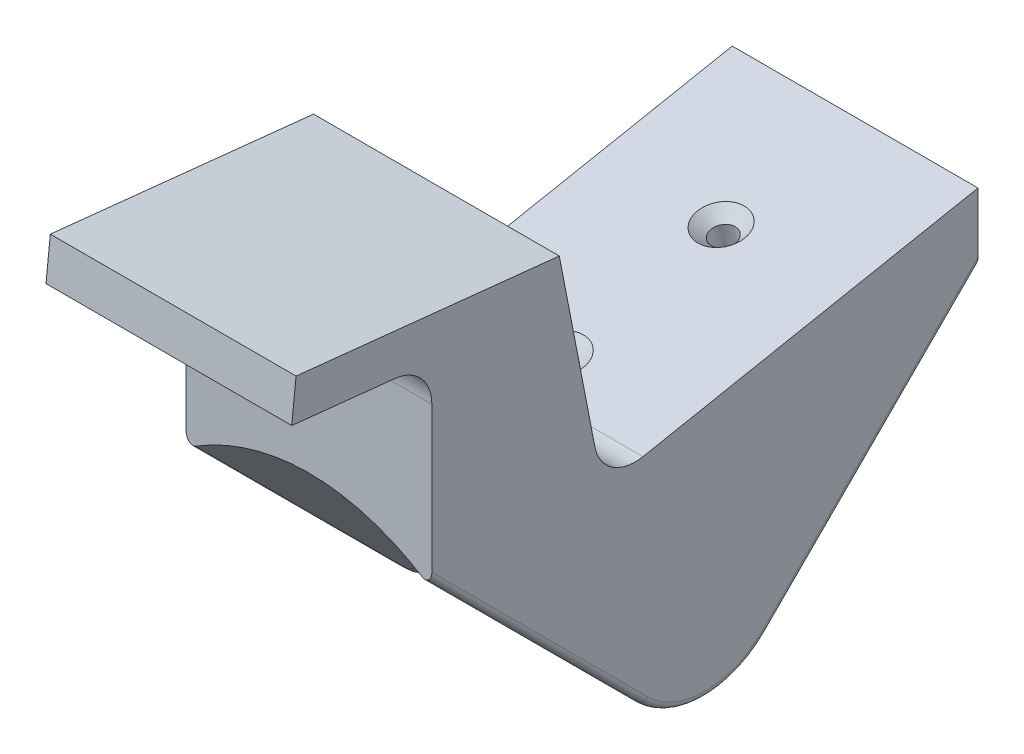
ISO-10303-21;
HEADER;
FILE_DESCRIPTION(('STEP AP214'),'2;1');
FILE_NAME('part.step','',(''),(''),'','','');
FILE_SCHEMA(('AUTOMOTIVE_DESIGN { 1 0 10303 214 1 1 1 1 }'));
ENDSEC;
DATA;
#1=APPLICATION_CONTEXT('core data for automotive mechanical design processes');
#2=APPLICATION_PROTOCOL_DEFINITION('international standard','automotive_design',2000,#1);
#3=PRODUCT_CONTEXT('',#1,'mechanical');
#4=PRODUCT('Part','Part','',(#3));
#5=PRODUCT_RELATED_PRODUCT_CATEGORY('part','',(#4));
#6=PRODUCT_DEFINITION_FORMATION('','',#4);
#7=PRODUCT_DEFINITION_CONTEXT('part definition',#1,'design');
#8=PRODUCT_DEFINITION('design','',#6,#7);
#9=PRODUCT_DEFINITION_SHAPE('','',#8);
#10=(LENGTH_UNIT() NAMED_UNIT(*) SI_UNIT(.MILLI.,.METRE.));
#11=(NAMED_UNIT(*) PLANE_ANGLE_UNIT() SI_UNIT($,.RADIAN.));
#12=(NAMED_UNIT(*) SI_UNIT($,.STERADIAN.) SOLID_ANGLE_UNIT());
#13=UNCERTAINTY_MEASURE_WITH_UNIT(LENGTH_MEASURE(1.E-05),#10,'distance_accuracy_value','');
#14=(GEOMETRIC_REPRESENTATION_CONTEXT(3) GLOBAL_UNCERTAINTY_ASSIGNED_CONTEXT((#13)) GLOBAL_UNIT_ASSIGNED_CONTEXT((#10,
#11,#12)) REPRESENTATION_CONTEXT('',''));
#15=CARTESIAN_POINT('',(0.,0.,0.));
#16=DIRECTION('',(0.,0.,1.));
#17=DIRECTION('',(1.,0.,0.));
#18=AXIS2_PLACEMENT_3D('',#15,#16,#17);
#19=CARTESIAN_POINT('',(9.,0.,0.));
#20=DIRECTION('',(1.,0.,0.));
#21=DIRECTION('',(0.,0.,-1.));
#22=AXIS2_PLACEMENT_3D('',#19,#20,#21);
#23=PLANE('',#22);
#24=DIRECTION('',(0.,0.104528463267647,0.994521895368274));
#25=VECTOR('',#24,1.);
#26=CARTESIAN_POINT('',(9.,27.0189501731692,10.6659343997796));
#27=LINE('',#26,#25);
#28=CARTESIAN_POINT('',(9.,27.0189501731692,10.6659343997796));
#29=VERTEX_POINT('',#28);
#30=CARTESIAN_POINT('',(9.,29.0452846326765,29.9452189536827));
#31=VERTEX_POINT('',#30);
#32=EDGE_CURVE('E169',#29,#31,#27,.T.);
#33=ORIENTED_EDGE('',*,*,#32,.T.);
#34=DIRECTION('',(0.,0.994521895368274,-0.104528463267647));
#35=VECTOR('',#34,1.);
#36=CARTESIAN_POINT('',(9.,29.0452846326765,29.9452189536827));
#37=LINE('',#36,#35);
#38=CARTESIAN_POINT('',(9.,26.0617189465716,30.2588043434857));
#39=VERTEX_POINT('',#38);
#40=EDGE_CURVE('E167',#39,#31,#37,.T.);
#41=ORIENTED_EDGE('',*,*,#40,.F.);
#42=DIRECTION('',(0.,0.104528463267647,0.994521895368274));
#43=VECTOR('',#42,1.);
#44=CARTESIAN_POINT('',(9.,26.0617189465716,30.2588043434857));
#45=LINE('',#44,#43);
#46=CARTESIAN_POINT('',(9.,25.2658287145207,22.6864146101971));
#47=VERTEX_POINT('',#46);
#48=EDGE_CURVE('E156',#47,#39,#45,.T.);
#49=ORIENTED_EDGE('',*,*,#48,.F.);
#50=CARTESIAN_POINT('',(9.,22.2822630284159,23.));
#51=DIRECTION('',(1.,0.,0.));
#52=DIRECTION('',(0.,0.,-1.));
#53=AXIS2_PLACEMENT_3D('',#50,#51,#52);
#54=CIRCLE('',#53,3.);
#55=CARTESIAN_POINT('',(9.,22.2822630284159,20.));
#56=VERTEX_POINT('',#55);
#57=EDGE_CURVE('E11',#47,#56,#54,.F.);
#58=ORIENTED_EDGE('',*,*,#57,.T.);
#59=DIRECTION('',(0.,1.,0.));
#60=VECTOR('',#59,1.);
#61=CARTESIAN_POINT('',(9.,30.,20.));
#62=LINE('',#61,#60);
#63=CARTESIAN_POINT('',(9.,11.6246971195752,20.));
#64=VERTEX_POINT('',#63);
#65=EDGE_CURVE('E230',#64,#56,#62,.T.);
#66=ORIENTED_EDGE('',*,*,#65,.F.);
#67=DIRECTION('',(0.,-0.707106781186552,-0.707106781186544));
#68=VECTOR('',#67,1.);
#69=CARTESIAN_POINT('',(9.,11.073873766785,19.4491766472098));
#70=LINE('',#69,#68);
#71=CARTESIAN_POINT('',(9.,-4.18765144021247,4.18765144021251));
#72=VERTEX_POINT('',#71);
#73=EDGE_CURVE('E288',#72,#64,#70,.F.);
#74=ORIENTED_EDGE('',*,*,#73,.F.);
#75=CARTESIAN_POINT('',(9.,0.,0.));
#76=DIRECTION('',(1.,0.,0.));
#77=DIRECTION('',(0.,0.,-1.));
#78=AXIS2_PLACEMENT_3D('',#75,#76,#77);
#79=CIRCLE('',#78,5.92223346123973);
#80=CARTESIAN_POINT('',(9.,-4.18765144021247,-4.18765144021251));
#81=VERTEX_POINT('',#80);
#82=EDGE_CURVE('E324',#72,#81,#79,.T.);
#83=ORIENTED_EDGE('',*,*,#82,.T.);
#84=DIRECTION('',(0.,-0.707106781186552,0.707106781186544));
#85=VECTOR('',#84,1.);
#86=CARTESIAN_POINT('',(9.,11.073873766785,-19.4491766472098));
#87=LINE('',#86,#85);
#88=CARTESIAN_POINT('',(9.,11.6246971195752,-20.));
#89=VERTEX_POINT('',#88);
#90=EDGE_CURVE('E326',#81,#89,#87,.F.);
#91=ORIENTED_EDGE('',*,*,#90,.T.);
#92=DIRECTION('',(0.,1.,0.));
#93=VECTOR('',#92,1.);
#94=CARTESIAN_POINT('',(9.,30.,-20.));
#95=LINE('',#94,#93);
#96=CARTESIAN_POINT('',(9.,16.,-20.));
#97=VERTEX_POINT('',#96);
#98=EDGE_CURVE('E308',#89,#97,#95,.T.);
#99=ORIENTED_EDGE('',*,*,#98,.T.);
#100=DIRECTION('',(0.,0.190808995376538,-0.981627183447665));
#101=VECTOR('',#100,1.);
#102=CARTESIAN_POINT('',(9.,11.6714049023753,2.26869129299512));
#103=LINE('',#102,#101);
#104=CARTESIAN_POINT('',(9.,11.2297751155865,4.54067958619163));
#105=VERTEX_POINT('',#104);
#106=EDGE_CURVE('E214',#105,#97,#103,.T.);
#107=ORIENTED_EDGE('',*,*,#106,.F.);
#108=CARTESIAN_POINT('',(9.,14.1746566659295,5.11310657232125));
#109=DIRECTION('',(1.,0.,0.));
#110=DIRECTION('',(0.,0.,-1.));
#111=AXIS2_PLACEMENT_3D('',#108,#109,#110);
#112=CIRCLE('',#111,3.);
#113=CARTESIAN_POINT('',(9.,13.6022296797999,8.05798812266424));
#114=VERTEX_POINT('',#113);
#115=EDGE_CURVE('E247',#105,#114,#112,.F.);
#116=ORIENTED_EDGE('',*,*,#115,.T.);
#117=DIRECTION('',(0.,-0.981627183447665,-0.190808995376539));
#118=VECTOR('',#117,1.);
#119=CARTESIAN_POINT('',(9.,-1.01405677291842,5.2168698435395));
#120=LINE('',#119,#118);
#121=EDGE_CURVE('E209',#29,#114,#120,.T.);
#122=ORIENTED_EDGE('',*,*,#121,.F.);
#123=EDGE_LOOP('',(#33,#41,#49,#58,#66,#74,#83,#91,#99,#107,#116,#122));
#124=FACE_BOUND('',#123,.T.);
#125=ADVANCED_FACE('F41',(#124),#23,.T.);
#126=CARTESIAN_POINT('',(-9.,0.,0.));
#127=DIRECTION('',(1.,0.,0.));
#128=DIRECTION('',(0.,0.,-1.));
#129=AXIS2_PLACEMENT_3D('',#126,#127,#128);
#130=PLANE('',#129);
#131=DIRECTION('',(0.,1.,0.));
#132=VECTOR('',#131,1.);
#133=CARTESIAN_POINT('',(-9.,30.,20.));
#134=LINE('',#133,#132);
#135=CARTESIAN_POINT('',(-9.,11.6246971195752,20.));
#136=VERTEX_POINT('',#135);
#137=CARTESIAN_POINT('',(-9.,22.2822630284159,20.));
#138=VERTEX_POINT('',#137);
#139=EDGE_CURVE('E224',#136,#138,#134,.T.);
#140=ORIENTED_EDGE('',*,*,#139,.T.);
#141=CARTESIAN_POINT('',(-9.,22.2822630284159,23.));
#142=DIRECTION('',(1.,0.,0.));
#143=DIRECTION('',(0.,0.,-1.));
#144=AXIS2_PLACEMENT_3D('',#141,#142,#143);
#145=CIRCLE('',#144,3.);
#146=CARTESIAN_POINT('',(-9.,25.2658287145207,22.6864146101971));
#147=VERTEX_POINT('',#146);
#148=EDGE_CURVE('E49',#138,#147,#145,.T.);
#149=ORIENTED_EDGE('',*,*,#148,.T.);
#150=DIRECTION('',(0.,0.104528463267647,0.994521895368274));
#151=VECTOR('',#150,1.);
#152=CARTESIAN_POINT('',(-9.,26.0617189465716,30.2588043434857));
#153=LINE('',#152,#151);
#154=CARTESIAN_POINT('',(-9.,26.0617189465716,30.2588043434857));
#155=VERTEX_POINT('',#154);
#156=EDGE_CURVE('E243',#147,#155,#153,.T.);
#157=ORIENTED_EDGE('',*,*,#156,.T.);
#158=DIRECTION('',(0.,0.994521895368274,-0.104528463267647));
#159=VECTOR('',#158,1.);
#160=CARTESIAN_POINT('',(-9.,29.0452846326765,29.9452189536827));
#161=LINE('',#160,#159);
#162=CARTESIAN_POINT('',(-9.,29.0452846326765,29.9452189536827));
#163=VERTEX_POINT('',#162);
#164=EDGE_CURVE('E164',#155,#163,#161,.T.);
#165=ORIENTED_EDGE('',*,*,#164,.T.);
#166=DIRECTION('',(0.,0.104528463267647,0.994521895368274));
#167=VECTOR('',#166,1.);
#168=CARTESIAN_POINT('',(-9.,27.0189501731692,10.6659343997796));
#169=LINE('',#168,#167);
#170=CARTESIAN_POINT('',(-9.,27.0189501731692,10.6659343997796));
#171=VERTEX_POINT('',#170);
#172=EDGE_CURVE('E182',#171,#163,#169,.T.);
#173=ORIENTED_EDGE('',*,*,#172,.F.);
#174=DIRECTION('',(0.,-0.981627183447665,-0.190808995376539));
#175=VECTOR('',#174,1.);
#176=CARTESIAN_POINT('',(-9.,-1.01405677291842,5.2168698435395));
#177=LINE('',#176,#175);
#178=CARTESIAN_POINT('',(-9.,13.6022296797999,8.05798812266424));
#179=VERTEX_POINT('',#178);
#180=EDGE_CURVE('E206',#171,#179,#177,.T.);
#181=ORIENTED_EDGE('',*,*,#180,.T.);
#182=CARTESIAN_POINT('',(-9.,14.1746566659295,5.11310657232125));
#183=DIRECTION('',(1.,0.,0.));
#184=DIRECTION('',(0.,0.,-1.));
#185=AXIS2_PLACEMENT_3D('',#182,#183,#184);
#186=CIRCLE('',#185,3.);
#187=CARTESIAN_POINT('',(-9.,11.2297751155865,4.54067958619163));
#188=VERTEX_POINT('',#187);
#189=EDGE_CURVE('E250',#179,#188,#186,.T.);
#190=ORIENTED_EDGE('',*,*,#189,.T.);
#191=DIRECTION('',(0.,0.190808995376538,-0.981627183447665));
#192=VECTOR('',#191,1.);
#193=CARTESIAN_POINT('',(-9.,11.6714049023753,2.26869129299512));
#194=LINE('',#193,#192);
#195=CARTESIAN_POINT('',(-9.,16.,-20.));
#196=VERTEX_POINT('',#195);
#197=EDGE_CURVE('E212',#188,#196,#194,.T.);
#198=ORIENTED_EDGE('',*,*,#197,.T.);
#199=DIRECTION('',(0.,1.,0.));
#200=VECTOR('',#199,1.);
#201=CARTESIAN_POINT('',(-9.,30.,-20.));
#202=LINE('',#201,#200);
#203=CARTESIAN_POINT('',(-9.,11.6246971195752,-20.));
#204=VERTEX_POINT('',#203);
#205=EDGE_CURVE('E307',#204,#196,#202,.T.);
#206=ORIENTED_EDGE('',*,*,#205,.F.);
#207=DIRECTION('',(0.,0.707106781186552,-0.707106781186544));
#208=VECTOR('',#207,1.);
#209=CARTESIAN_POINT('',(-9.,-4.18765144021246,-4.18765144021251));
#210=LINE('',#209,#208);
#211=CARTESIAN_POINT('',(-9.,-4.18765144021247,-4.18765144021251));
#212=VERTEX_POINT('',#211);
#213=EDGE_CURVE('E322',#204,#212,#210,.F.);
#214=ORIENTED_EDGE('',*,*,#213,.T.);
#215=CARTESIAN_POINT('',(-9.,0.,0.));
#216=DIRECTION('',(1.,0.,0.));
#217=DIRECTION('',(0.,0.,-1.));
#218=AXIS2_PLACEMENT_3D('',#215,#216,#217);
#219=CIRCLE('',#218,5.92223346123973);
#220=CARTESIAN_POINT('',(-9.,-4.18765144021247,4.18765144021251));
#221=VERTEX_POINT('',#220);
#222=EDGE_CURVE('E284',#212,#221,#219,.F.);
#223=ORIENTED_EDGE('',*,*,#222,.T.);
#224=DIRECTION('',(0.,0.707106781186552,0.707106781186544));
#225=VECTOR('',#224,1.);
#226=CARTESIAN_POINT('',(-9.,-4.18765144021246,4.18765144021251));
#227=LINE('',#226,#225);
#228=EDGE_CURVE('E282',#136,#221,#227,.F.);
#229=ORIENTED_EDGE('',*,*,#228,.F.);
#230=EDGE_LOOP('',(#140,#149,#157,#165,#173,#181,#190,#198,#206,#214,#223,#229));
#231=FACE_BOUND('',#230,.T.);
#232=ADVANCED_FACE('F253',(#231),#130,.F.);
#233=CARTESIAN_POINT('',(0.,-17.974654377762,-17.9746543777621));
#234=DIRECTION('',(0.,0.707106781186552,-0.707106781186544));
#235=DIRECTION('',(0.,0.707106781186544,0.707106781186552));
#236=AXIS2_PLACEMENT_3D('',#233,#234,#235);
#237=CYLINDRICAL_SURFACE('',#236,20.77);
#238=CARTESIAN_POINT('',(0.,-17.974654377762,-17.9746543777621));
#239=DIRECTION('',(0.,0.707106781186551,-0.707106781186544));
#240=DIRECTION('',(1.,0.,0.));
#241=AXIS2_PLACEMENT_3D('',#238,#239,#240);
#242=CIRCLE('',#241,20.77);
#243=CARTESIAN_POINT('',(-8.30018805829807,-4.51174647870681,-4.51174647870686));
#244=VERTEX_POINT('',#243);
#245=CARTESIAN_POINT('',(8.30018805829807,-4.51174647870682,-4.51174647870686));
#246=VERTEX_POINT('',#245);
#247=EDGE_CURVE('E303',#244,#246,#242,.T.);
#248=ORIENTED_EDGE('',*,*,#247,.F.);
#249=DIRECTION('',(0.,0.707106781186552,-0.707106781186544));
#250=VECTOR('',#249,1.);
#251=CARTESIAN_POINT('',(-8.30018805829807,-4.51174647870682,-4.51174647870685));
#252=LINE('',#251,#250);
#253=CARTESIAN_POINT('',(-8.30018805829807,10.9765070425865,-20.));
#254=VERTEX_POINT('',#253);
#255=EDGE_CURVE('E314',#244,#254,#252,.T.);
#256=ORIENTED_EDGE('',*,*,#255,.T.);
#257=CARTESIAN_POINT('',(0.,-15.9493087555241,-20.));
#258=DIRECTION('',(0.,0.,-1.));
#259=DIRECTION('',(0.,1.,0.));
#260=AXIS2_PLACEMENT_3D('',#257,#258,#259);
#261=ELLIPSE('',#260,29.3732156904894,20.77);
#262=CARTESIAN_POINT('',(8.30018805829807,10.9765070425865,-20.));
#263=VERTEX_POINT('',#262);
#264=EDGE_CURVE('E300',#263,#254,#261,.F.);
#265=ORIENTED_EDGE('',*,*,#264,.F.);
#266=DIRECTION('',(0.,0.707106781186552,-0.707106781186544));
#267=VECTOR('',#266,1.);
#268=CARTESIAN_POINT('',(8.30018805829807,-4.51174647870682,-4.51174647870685));
#269=LINE('',#268,#267);
#270=EDGE_CURVE('E311',#263,#246,#269,.F.);
#271=ORIENTED_EDGE('',*,*,#270,.T.);
#272=EDGE_LOOP('',(#248,#256,#265,#271));
#273=FACE_BOUND('',#272,.T.);
#274=ADVANCED_FACE('F350',(#273),#237,.F.);
#275=CARTESIAN_POINT('',(9.,30.,-20.));
#276=DIRECTION('',(0.,0.,1.));
#277=DIRECTION('',(1.,0.,0.));
#278=AXIS2_PLACEMENT_3D('',#275,#276,#277);
#279=PLANE('',#278);
#280=ORIENTED_EDGE('',*,*,#205,.T.);
#281=DIRECTION('',(1.,0.,0.));
#282=VECTOR('',#281,1.);
#283=CARTESIAN_POINT('',(-20.,16.,-20.));
#284=LINE('',#283,#282);
#285=EDGE_CURVE('E203',#196,#97,#284,.T.);
#286=ORIENTED_EDGE('',*,*,#285,.T.);
#287=ORIENTED_EDGE('',*,*,#98,.F.);
#288=CARTESIAN_POINT('',(8.5,11.6246971195752,-20.));
#289=DIRECTION('',(0.,0.,1.));
#290=DIRECTION('',(0.,1.,0.));
#291=AXIS2_PLACEMENT_3D('',#288,#289,#290);
#292=ELLIPSE('',#291,0.707106781186552,0.5);
#293=EDGE_CURVE('E317',#89,#263,#292,.F.);
#294=ORIENTED_EDGE('',*,*,#293,.T.);
#295=ORIENTED_EDGE('',*,*,#264,.T.);
#296=CARTESIAN_POINT('',(-8.5,11.6246971195752,-20.));
#297=DIRECTION('',(0.,0.,1.));
#298=DIRECTION('',(0.,1.,0.));
#299=AXIS2_PLACEMENT_3D('',#296,#297,#298);
#300=ELLIPSE('',#299,0.707106781186552,0.5);
#301=EDGE_CURVE('E319',#254,#204,#300,.F.);
#302=ORIENTED_EDGE('',*,*,#301,.T.);
#303=EDGE_LOOP('',(#280,#286,#287,#294,#295,#302));
#304=FACE_BOUND('',#303,.T.);
#305=ADVANCED_FACE('F356',(#304),#279,.F.);
#306=CARTESIAN_POINT('',(0.,0.,0.));
#307=DIRECTION('',(-1.,0.,0.));
#308=DIRECTION('',(0.,0.,1.));
#309=AXIS2_PLACEMENT_3D('',#306,#307,#308);
#310=TOROIDAL_SURFACE('',#309,25.42,20.77);
#311=CARTESIAN_POINT('',(8.30018805829807,0.,0.));
#312=DIRECTION('',(-1.,0.,0.));
#313=DIRECTION('',(0.,0.,1.));
#314=AXIS2_PLACEMENT_3D('',#311,#312,#313);
#315=CIRCLE('',#314,6.38057306017627);
#316=CARTESIAN_POINT('',(8.30018805829807,-4.51174647870682,4.51174647870686));
#317=VERTEX_POINT('',#316);
#318=EDGE_CURVE('E271',#246,#317,#315,.T.);
#319=ORIENTED_EDGE('',*,*,#318,.T.);
#320=CARTESIAN_POINT('',(0.,-17.974654377762,17.9746543777621));
#321=DIRECTION('',(0.,-0.707106781186551,-0.707106781186544));
#322=DIRECTION('',(1.,0.,0.));
#323=AXIS2_PLACEMENT_3D('',#320,#321,#322);
#324=CIRCLE('',#323,20.77);
#325=CARTESIAN_POINT('',(-8.30018805829807,-4.51174647870682,4.51174647870686));
#326=VERTEX_POINT('',#325);
#327=EDGE_CURVE('E220',#326,#317,#324,.T.);
#328=ORIENTED_EDGE('',*,*,#327,.F.);
#329=CARTESIAN_POINT('',(-8.30018805829807,0.,0.));
#330=DIRECTION('',(1.,0.,0.));
#331=DIRECTION('',(0.,0.,-1.));
#332=AXIS2_PLACEMENT_3D('',#329,#330,#331);
#333=CIRCLE('',#332,6.38057306017626);
#334=EDGE_CURVE('E269',#326,#244,#333,.T.);
#335=ORIENTED_EDGE('',*,*,#334,.T.);
#336=ORIENTED_EDGE('',*,*,#247,.T.);
#337=EDGE_LOOP('',(#319,#328,#335,#336));
#338=FACE_BOUND('',#337,.T.);
#339=ADVANCED_FACE('F347',(#338),#310,.F.);
#340=CARTESIAN_POINT('',(-8.5,0.,0.));
#341=DIRECTION('',(-1.,0.,0.));
#342=DIRECTION('',(0.,0.,1.));
#343=AXIS2_PLACEMENT_3D('',#340,#341,#342);
#344=TOROIDAL_SURFACE('',#343,5.92223346123973,0.5);
#345=ORIENTED_EDGE('',*,*,#334,.F.);
#346=CARTESIAN_POINT('',(-8.5,-4.18765144021247,4.18765144021251));
#347=DIRECTION('',(0.,-0.70710678118655,-0.707106781186546));
#348=DIRECTION('',(0.,0.707106781186546,-0.70710678118655));
#349=AXIS2_PLACEMENT_3D('',#346,#347,#348);
#350=CIRCLE('',#349,0.5);
#351=EDGE_CURVE('E221',#326,#221,#350,.T.);
#352=ORIENTED_EDGE('',*,*,#351,.T.);
#353=ORIENTED_EDGE('',*,*,#222,.F.);
#354=CARTESIAN_POINT('',(-8.5,-4.18765144021247,-4.18765144021251));
#355=DIRECTION('',(0.,0.70710678118655,-0.707106781186546));
#356=DIRECTION('',(0.,0.707106781186546,0.70710678118655));
#357=AXIS2_PLACEMENT_3D('',#354,#355,#356);
#358=CIRCLE('',#357,0.5);
#359=EDGE_CURVE('E304',#244,#212,#358,.T.);
#360=ORIENTED_EDGE('',*,*,#359,.F.);
#361=EDGE_LOOP('',(#345,#352,#353,#360));
#362=FACE_BOUND('',#361,.T.);
#363=ADVANCED_FACE('F353',(#362),#344,.T.);
#364=CARTESIAN_POINT('',(-8.5,-4.18765144021247,-4.1876514402125));
#365=DIRECTION('',(0.,0.707106781186552,-0.707106781186544));
#366=DIRECTION('',(0.,0.707106781186544,0.707106781186552));
#367=AXIS2_PLACEMENT_3D('',#364,#365,#366);
#368=CYLINDRICAL_SURFACE('',#367,0.5);
#369=ORIENTED_EDGE('',*,*,#359,.T.);
#370=ORIENTED_EDGE('',*,*,#213,.F.);
#371=ORIENTED_EDGE('',*,*,#301,.F.);
#372=ORIENTED_EDGE('',*,*,#255,.F.);
#373=EDGE_LOOP('',(#369,#370,#371,#372));
#374=FACE_BOUND('',#373,.T.);
#375=ADVANCED_FACE('F354',(#374),#368,.T.);
#376=CARTESIAN_POINT('',(8.5,0.,0.));
#377=DIRECTION('',(-1.,0.,0.));
#378=DIRECTION('',(0.,0.,1.));
#379=AXIS2_PLACEMENT_3D('',#376,#377,#378);
#380=TOROIDAL_SURFACE('',#379,5.92223346123973,0.5);
#381=ORIENTED_EDGE('',*,*,#82,.F.);
#382=CARTESIAN_POINT('',(8.5,-4.18765144021247,4.18765144021251));
#383=DIRECTION('',(0.,-0.707106781186551,-0.707106781186544));
#384=DIRECTION('',(0.,0.707106781186544,-0.707106781186551));
#385=AXIS2_PLACEMENT_3D('',#382,#383,#384);
#386=CIRCLE('',#385,0.5);
#387=EDGE_CURVE('E216',#72,#317,#386,.T.);
#388=ORIENTED_EDGE('',*,*,#387,.T.);
#389=ORIENTED_EDGE('',*,*,#318,.F.);
#390=CARTESIAN_POINT('',(8.5,-4.18765144021247,-4.18765144021251));
#391=DIRECTION('',(0.,0.707106781186551,-0.707106781186544));
#392=DIRECTION('',(0.,0.707106781186544,0.707106781186551));
#393=AXIS2_PLACEMENT_3D('',#390,#391,#392);
#394=CIRCLE('',#393,0.5);
#395=EDGE_CURVE('E235',#81,#246,#394,.T.);
#396=ORIENTED_EDGE('',*,*,#395,.F.);
#397=EDGE_LOOP('',(#381,#388,#389,#396));
#398=FACE_BOUND('',#397,.T.);
#399=ADVANCED_FACE('F342',(#398),#380,.T.);
#400=CARTESIAN_POINT('',(8.5,-4.18765144021247,-4.1876514402125));
#401=DIRECTION('',(0.,0.707106781186552,-0.707106781186544));
#402=DIRECTION('',(0.,0.707106781186544,0.707106781186552));
#403=AXIS2_PLACEMENT_3D('',#400,#401,#402);
#404=CYLINDRICAL_SURFACE('',#403,0.5);
#405=ORIENTED_EDGE('',*,*,#395,.T.);
#406=ORIENTED_EDGE('',*,*,#270,.F.);
#407=ORIENTED_EDGE('',*,*,#293,.F.);
#408=ORIENTED_EDGE('',*,*,#90,.F.);
#409=EDGE_LOOP('',(#405,#406,#407,#408));
#410=FACE_BOUND('',#409,.T.);
#411=ADVANCED_FACE('F339',(#410),#404,.T.);
#412=CARTESIAN_POINT('',(0.,-17.974654377762,17.9746543777621));
#413=DIRECTION('',(0.,0.707106781186552,0.707106781186544));
#414=DIRECTION('',(0.,0.707106781186544,-0.707106781186552));
#415=AXIS2_PLACEMENT_3D('',#412,#413,#414);
#416=CYLINDRICAL_SURFACE('',#415,20.77);
#417=ORIENTED_EDGE('',*,*,#327,.T.);
#418=DIRECTION('',(0.,0.707106781186552,0.707106781186544));
#419=VECTOR('',#418,1.);
#420=CARTESIAN_POINT('',(8.30018805829807,-4.51174647870682,4.51174647870685));
#421=LINE('',#420,#419);
#422=CARTESIAN_POINT('',(8.30018805829807,10.9765070425865,20.));
#423=VERTEX_POINT('',#422);
#424=EDGE_CURVE('E234',#423,#317,#421,.F.);
#425=ORIENTED_EDGE('',*,*,#424,.F.);
#426=CARTESIAN_POINT('',(0.,-15.9493087555241,20.));
#427=DIRECTION('',(0.,0.,-1.));
#428=DIRECTION('',(0.,1.,0.));
#429=AXIS2_PLACEMENT_3D('',#426,#427,#428);
#430=ELLIPSE('',#429,29.3732156904894,20.77);
#431=CARTESIAN_POINT('',(-8.30018805829807,10.9765070425865,20.));
#432=VERTEX_POINT('',#431);
#433=EDGE_CURVE('E217',#423,#432,#430,.F.);
#434=ORIENTED_EDGE('',*,*,#433,.T.);
#435=DIRECTION('',(0.,0.707106781186552,0.707106781186544));
#436=VECTOR('',#435,1.);
#437=CARTESIAN_POINT('',(-8.30018805829807,-4.51174647870682,4.51174647870685));
#438=LINE('',#437,#436);
#439=EDGE_CURVE('E364',#326,#432,#438,.T.);
#440=ORIENTED_EDGE('',*,*,#439,.F.);
#441=EDGE_LOOP('',(#417,#425,#434,#440));
#442=FACE_BOUND('',#441,.T.);
#443=ADVANCED_FACE('F366',(#442),#416,.F.);
#444=CARTESIAN_POINT('',(9.,30.,20.));
#445=DIRECTION('',(0.,0.,-1.));
#446=DIRECTION('',(1.,0.,0.));
#447=AXIS2_PLACEMENT_3D('',#444,#445,#446);
#448=PLANE('',#447);
#449=ORIENTED_EDGE('',*,*,#65,.T.);
#450=DIRECTION('',(-1.,0.,0.));
#451=VECTOR('',#450,1.);
#452=CARTESIAN_POINT('',(9.,22.2822630284159,20.));
#453=LINE('',#452,#451);
#454=EDGE_CURVE('E248',#56,#138,#453,.T.);
#455=ORIENTED_EDGE('',*,*,#454,.T.);
#456=ORIENTED_EDGE('',*,*,#139,.F.);
#457=CARTESIAN_POINT('',(-8.5,11.6246971195752,20.));
#458=DIRECTION('',(0.,0.,1.));
#459=DIRECTION('',(0.,1.,0.));
#460=AXIS2_PLACEMENT_3D('',#457,#458,#459);
#461=ELLIPSE('',#460,0.707106781186552,0.5);
#462=EDGE_CURVE('E289',#432,#136,#461,.F.);
#463=ORIENTED_EDGE('',*,*,#462,.F.);
#464=ORIENTED_EDGE('',*,*,#433,.F.);
#465=CARTESIAN_POINT('',(8.5,11.6246971195752,20.));
#466=DIRECTION('',(0.,0.,1.));
#467=DIRECTION('',(0.,1.,0.));
#468=AXIS2_PLACEMENT_3D('',#465,#466,#467);
#469=ELLIPSE('',#468,0.707106781186552,0.5);
#470=EDGE_CURVE('E293',#64,#423,#469,.F.);
#471=ORIENTED_EDGE('',*,*,#470,.F.);
#472=EDGE_LOOP('',(#449,#455,#456,#463,#464,#471));
#473=FACE_BOUND('',#472,.T.);
#474=ADVANCED_FACE('F277',(#473),#448,.F.);
#475=CARTESIAN_POINT('',(-8.5,-4.18765144021248,4.1876514402125));
#476=DIRECTION('',(0.,0.707106781186552,0.707106781186544));
#477=DIRECTION('',(0.,0.707106781186544,-0.707106781186552));
#478=AXIS2_PLACEMENT_3D('',#475,#476,#477);
#479=CYLINDRICAL_SURFACE('',#478,0.5);
#480=ORIENTED_EDGE('',*,*,#351,.F.);
#481=ORIENTED_EDGE('',*,*,#439,.T.);
#482=ORIENTED_EDGE('',*,*,#462,.T.);
#483=ORIENTED_EDGE('',*,*,#228,.T.);
#484=EDGE_LOOP('',(#480,#481,#482,#483));
#485=FACE_BOUND('',#484,.T.);
#486=ADVANCED_FACE('F369',(#485),#479,.T.);
#487=CARTESIAN_POINT('',(8.5,-4.18765144021248,4.1876514402125));
#488=DIRECTION('',(0.,0.707106781186552,0.707106781186544));
#489=DIRECTION('',(0.,0.707106781186544,-0.707106781186552));
#490=AXIS2_PLACEMENT_3D('',#487,#488,#489);
#491=CYLINDRICAL_SURFACE('',#490,0.5);
#492=ORIENTED_EDGE('',*,*,#387,.F.);
#493=ORIENTED_EDGE('',*,*,#73,.T.);
#494=ORIENTED_EDGE('',*,*,#470,.T.);
#495=ORIENTED_EDGE('',*,*,#424,.T.);
#496=EDGE_LOOP('',(#492,#493,#494,#495));
#497=FACE_BOUND('',#496,.T.);
#498=ADVANCED_FACE('F360',(#497),#491,.T.);
#499=CARTESIAN_POINT('',(-20.,16.,-20.));
#500=DIRECTION('',(0.,-0.981627183447665,-0.190808995376538));
#501=DIRECTION('',(0.,0.190808995376538,-0.981627183447665));
#502=AXIS2_PLACEMENT_3D('',#499,#500,#501);
#503=PLANE('',#502);
#504=CARTESIAN_POINT('',(0.,14.0919100462346,-10.1837281655233));
#505=DIRECTION('',(0.,0.981627183447665,0.190808995376538));
#506=DIRECTION('',(0.,-0.190808995376538,0.981627183447665));
#507=AXIS2_PLACEMENT_3D('',#504,#505,#506);
#508=CIRCLE('',#507,1.7272);
#509=CARTESIAN_POINT('',(0.,13.7623447494203,-8.48826169427254));
#510=VERTEX_POINT('',#509);
#511=EDGE_CURVE('E185',#510,#510,#508,.T.);
#512=ORIENTED_EDGE('',*,*,#511,.F.);
#513=EDGE_LOOP('',(#512));
#514=FACE_BOUND('',#513,.T.);
#515=CARTESIAN_POINT('',(0.,11.8022021017162,1.59579803584864));
#516=DIRECTION('',(0.,0.981627183447665,0.190808995376538));
#517=DIRECTION('',(0.,-0.190808995376538,0.981627183447665));
#518=AXIS2_PLACEMENT_3D('',#515,#516,#517);
#519=CIRCLE('',#518,1.7272);
#520=CARTESIAN_POINT('',(0.,11.4726368049018,3.29126450709944));
#521=VERTEX_POINT('',#520);
#522=EDGE_CURVE('E194',#521,#521,#519,.T.);
#523=ORIENTED_EDGE('',*,*,#522,.F.);
#524=EDGE_LOOP('',(#523));
#525=FACE_BOUND('',#524,.T.);
#526=ORIENTED_EDGE('',*,*,#197,.F.);
#527=DIRECTION('',(1.,0.,0.));
#528=VECTOR('',#527,1.);
#529=CARTESIAN_POINT('',(9.,11.2297751155865,4.54067958619163));
#530=LINE('',#529,#528);
#531=EDGE_CURVE('E264',#188,#105,#530,.T.);
#532=ORIENTED_EDGE('',*,*,#531,.T.);
#533=ORIENTED_EDGE('',*,*,#106,.T.);
#534=ORIENTED_EDGE('',*,*,#285,.F.);
#535=EDGE_LOOP('',(#526,#532,#533,#534));
#536=FACE_BOUND('',#535,.T.);
#537=ADVANCED_FACE('F263',(#514,#525,#536),#503,.F.);
#538=CARTESIAN_POINT('',(-20.,30.,11.2453917866739));
#539=DIRECTION('',(0.,-0.190808995376539,0.981627183447665));
#540=DIRECTION('',(0.,-0.981627183447665,-0.190808995376539));
#541=AXIS2_PLACEMENT_3D('',#538,#539,#540);
#542=PLANE('',#541);
#543=ORIENTED_EDGE('',*,*,#121,.T.);
#544=DIRECTION('',(1.,0.,0.));
#545=VECTOR('',#544,1.);
#546=CARTESIAN_POINT('',(-9.,13.6022296797999,8.05798812266424));
#547=LINE('',#546,#545);
#548=EDGE_CURVE('E268',#114,#179,#547,.F.);
#549=ORIENTED_EDGE('',*,*,#548,.T.);
#550=ORIENTED_EDGE('',*,*,#180,.F.);
#551=DIRECTION('',(-1.,0.,0.));
#552=VECTOR('',#551,1.);
#553=CARTESIAN_POINT('',(9.,27.0189501731692,10.6659343997796));
#554=LINE('',#553,#552);
#555=EDGE_CURVE('E181',#29,#171,#554,.T.);
#556=ORIENTED_EDGE('',*,*,#555,.F.);
#557=EDGE_LOOP('',(#543,#549,#550,#556));
#558=FACE_BOUND('',#557,.T.);
#559=ADVANCED_FACE('F434',(#558),#542,.F.);
#560=CARTESIAN_POINT('',(0.,5.28419760362366,0.328826306548421));
#561=DIRECTION('',(0.,0.981627183447665,0.190808995376538));
#562=DIRECTION('',(0.,-0.190808995376538,0.981627183447665));
#563=AXIS2_PLACEMENT_3D('',#560,#561,#562);
#564=CONICAL_SURFACE('',#563,0.888999999999987,1.02974425867665);
#565=CARTESIAN_POINT('',(0.,4.7598466305212,0.226902802300103));
#566=VERTEX_POINT('',#565);
#567=VERTEX_LOOP('',#566);
#568=FACE_BOUND('',#567,.T.);
#569=CARTESIAN_POINT('',(0.,5.28419760362366,0.328826306548421));
#570=DIRECTION('',(0.,0.981627183447665,0.190808995376538));
#571=DIRECTION('',(0.,-0.190808995376538,0.981627183447665));
#572=AXIS2_PLACEMENT_3D('',#569,#570,#571);
#573=CIRCLE('',#572,0.888999999999987);
#574=CARTESIAN_POINT('',(0.,5.11456840673392,1.20149287263338));
#575=VERTEX_POINT('',#574);
#576=EDGE_CURVE('E200',#575,#575,#573,.T.);
#577=ORIENTED_EDGE('',*,*,#576,.T.);
#578=EDGE_LOOP('',(#577));
#579=FACE_BOUND('',#578,.T.);
#580=ADVANCED_FACE('F430',(#568,#579),#564,.F.);
#581=CARTESIAN_POINT('',(0.,11.8022021017162,1.59579803584864));
#582=DIRECTION('',(0.,0.981627183447665,0.190808995376538));
#583=DIRECTION('',(0.,-0.190808995376538,0.981627183447665));
#584=AXIS2_PLACEMENT_3D('',#581,#582,#583);
#585=CYLINDRICAL_SURFACE('',#584,0.888999999999988);
#586=ORIENTED_EDGE('',*,*,#576,.F.);
#587=EDGE_LOOP('',(#586));
#588=FACE_BOUND('',#587,.T.);
#589=CARTESIAN_POINT('',(0.,10.9794021965503,1.43586193592402));
#590=DIRECTION('',(0.,0.981627183447665,0.190808995376538));
#591=DIRECTION('',(0.,-0.190808995376538,0.981627183447665));
#592=AXIS2_PLACEMENT_3D('',#589,#590,#591);
#593=CIRCLE('',#592,0.888999999999989);
#594=CARTESIAN_POINT('',(0.,10.8097729996606,2.30852850200898));
#595=VERTEX_POINT('',#594);
#596=EDGE_CURVE('E197',#595,#595,#593,.T.);
#597=ORIENTED_EDGE('',*,*,#596,.T.);
#598=EDGE_LOOP('',(#597));
#599=FACE_BOUND('',#598,.T.);
#600=ADVANCED_FACE('F426',(#588,#599),#585,.F.);
#601=CARTESIAN_POINT('',(0.,11.8022021017162,1.59579803584864));
#602=DIRECTION('',(0.,0.981627183447665,0.190808995376538));
#603=DIRECTION('',(0.,-0.190808995376538,0.981627183447665));
#604=AXIS2_PLACEMENT_3D('',#601,#602,#603);
#605=CONICAL_SURFACE('',#604,1.7272,0.785398163397447);
#606=ORIENTED_EDGE('',*,*,#596,.F.);
#607=EDGE_LOOP('',(#606));
#608=FACE_BOUND('',#607,.T.);
#609=ORIENTED_EDGE('',*,*,#522,.T.);
#610=EDGE_LOOP('',(#609));
#611=FACE_BOUND('',#610,.T.);
#612=ADVANCED_FACE('F422',(#608,#611),#605,.F.);
#613=CARTESIAN_POINT('',(0.,7.57390554814213,-11.4506998948236));
#614=DIRECTION('',(0.,0.981627183447665,0.190808995376538));
#615=DIRECTION('',(0.,-0.190808995376538,0.981627183447665));
#616=AXIS2_PLACEMENT_3D('',#613,#614,#615);
#617=CONICAL_SURFACE('',#616,0.888999999999987,1.02974425867665);
#618=CARTESIAN_POINT('',(0.,7.04955457503966,-11.5526233990719));
#619=VERTEX_POINT('',#618);
#620=VERTEX_LOOP('',#619);
#621=FACE_BOUND('',#620,.T.);
#622=CARTESIAN_POINT('',(0.,7.57390554814213,-11.4506998948236));
#623=DIRECTION('',(0.,0.981627183447665,0.190808995376538));
#624=DIRECTION('',(0.,-0.190808995376538,0.981627183447665));
#625=AXIS2_PLACEMENT_3D('',#622,#623,#624);
#626=CIRCLE('',#625,0.888999999999987);
#627=CARTESIAN_POINT('',(0.,7.40427635125239,-10.5780333287386));
#628=VERTEX_POINT('',#627);
#629=EDGE_CURVE('E191',#628,#628,#626,.T.);
#630=ORIENTED_EDGE('',*,*,#629,.T.);
#631=EDGE_LOOP('',(#630));
#632=FACE_BOUND('',#631,.T.);
#633=ADVANCED_FACE('F418',(#621,#632),#617,.F.);
#634=CARTESIAN_POINT('',(0.,14.0919100462346,-10.1837281655233));
#635=DIRECTION('',(0.,0.981627183447665,0.190808995376538));
#636=DIRECTION('',(0.,-0.190808995376538,0.981627183447665));
#637=AXIS2_PLACEMENT_3D('',#634,#635,#636);
#638=CYLINDRICAL_SURFACE('',#637,0.888999999999988);
#639=ORIENTED_EDGE('',*,*,#629,.F.);
#640=EDGE_LOOP('',(#639));
#641=FACE_BOUND('',#640,.T.);
#642=CARTESIAN_POINT('',(0.,13.2691101410688,-10.343664265448));
#643=DIRECTION('',(0.,0.981627183447665,0.190808995376538));
#644=DIRECTION('',(0.,-0.190808995376538,0.981627183447665));
#645=AXIS2_PLACEMENT_3D('',#642,#643,#644);
#646=CIRCLE('',#645,0.888999999999989);
#647=CARTESIAN_POINT('',(0.,13.099480944179,-9.470997699363));
#648=VERTEX_POINT('',#647);
#649=EDGE_CURVE('E188',#648,#648,#646,.T.);
#650=ORIENTED_EDGE('',*,*,#649,.T.);
#651=EDGE_LOOP('',(#650));
#652=FACE_BOUND('',#651,.T.);
#653=ADVANCED_FACE('F414',(#641,#652),#638,.F.);
#654=CARTESIAN_POINT('',(0.,14.0919100462346,-10.1837281655233));
#655=DIRECTION('',(0.,0.981627183447665,0.190808995376538));
#656=DIRECTION('',(0.,-0.190808995376538,0.981627183447665));
#657=AXIS2_PLACEMENT_3D('',#654,#655,#656);
#658=CONICAL_SURFACE('',#657,1.7272,0.785398163397447);
#659=ORIENTED_EDGE('',*,*,#649,.F.);
#660=EDGE_LOOP('',(#659));
#661=FACE_BOUND('',#660,.T.);
#662=ORIENTED_EDGE('',*,*,#511,.T.);
#663=EDGE_LOOP('',(#662));
#664=FACE_BOUND('',#663,.T.);
#665=ADVANCED_FACE('F410',(#661,#664),#658,.F.);
#666=CARTESIAN_POINT('',(9.,27.0189501731692,10.6659343997796));
#667=DIRECTION('',(0.,-0.994521895368274,0.104528463267647));
#668=DIRECTION('',(0.,-0.104528463267647,-0.994521895368274));
#669=AXIS2_PLACEMENT_3D('',#666,#667,#668);
#670=PLANE('',#669);
#671=ORIENTED_EDGE('',*,*,#172,.T.);
#672=DIRECTION('',(-1.,0.,0.));
#673=VECTOR('',#672,1.);
#674=CARTESIAN_POINT('',(20.0336468467868,29.0452846326765,29.9452189536827));
#675=LINE('',#674,#673);
#676=EDGE_CURVE('E173',#31,#163,#675,.T.);
#677=ORIENTED_EDGE('',*,*,#676,.F.);
#678=ORIENTED_EDGE('',*,*,#32,.F.);
#679=ORIENTED_EDGE('',*,*,#555,.T.);
#680=EDGE_LOOP('',(#671,#677,#678,#679));
#681=FACE_BOUND('',#680,.T.);
#682=ADVANCED_FACE('F405',(#681),#670,.F.);
#683=CARTESIAN_POINT('',(20.0336468467868,26.0617189465716,30.2588043434857));
#684=DIRECTION('',(0.,-0.994521895368274,0.104528463267647));
#685=DIRECTION('',(0.,-0.104528463267647,-0.994521895368274));
#686=AXIS2_PLACEMENT_3D('',#683,#684,#685);
#687=PLANE('',#686);
#688=ORIENTED_EDGE('',*,*,#156,.F.);
#689=DIRECTION('',(-1.,0.,0.));
#690=VECTOR('',#689,1.);
#691=CARTESIAN_POINT('',(20.0336468467868,25.2658287145207,22.6864146101971));
#692=LINE('',#691,#690);
#693=EDGE_CURVE('E62',#147,#47,#692,.F.);
#694=ORIENTED_EDGE('',*,*,#693,.T.);
#695=ORIENTED_EDGE('',*,*,#48,.T.);
#696=DIRECTION('',(-1.,0.,0.));
#697=VECTOR('',#696,1.);
#698=CARTESIAN_POINT('',(20.0336468467868,26.0617189465716,30.2588043434857));
#699=LINE('',#698,#697);
#700=EDGE_CURVE('E160',#39,#155,#699,.T.);
#701=ORIENTED_EDGE('',*,*,#700,.T.);
#702=EDGE_LOOP('',(#688,#694,#695,#701));
#703=FACE_BOUND('',#702,.T.);
#704=ADVANCED_FACE('F158',(#703),#687,.T.);
#705=CARTESIAN_POINT('',(20.0336468467868,29.0452846326765,29.9452189536827));
#706=DIRECTION('',(0.,0.104528463267647,0.994521895368274));
#707=DIRECTION('',(0.,-0.994521895368274,0.104528463267647));
#708=AXIS2_PLACEMENT_3D('',#705,#706,#707);
#709=PLANE('',#708);
#710=ORIENTED_EDGE('',*,*,#700,.F.);
#711=ORIENTED_EDGE('',*,*,#40,.T.);
#712=ORIENTED_EDGE('',*,*,#676,.T.);
#713=ORIENTED_EDGE('',*,*,#164,.F.);
#714=EDGE_LOOP('',(#710,#711,#712,#713));
#715=FACE_BOUND('',#714,.T.);
#716=ADVANCED_FACE('F175',(#715),#709,.T.);
#717=CARTESIAN_POINT('',(-20.,14.1746566659295,5.11310657232125));
#718=DIRECTION('',(-1.,0.,0.));
#719=DIRECTION('',(0.,0.,1.));
#720=AXIS2_PLACEMENT_3D('',#717,#718,#719);
#721=CYLINDRICAL_SURFACE('',#720,3.);
#722=ORIENTED_EDGE('',*,*,#189,.F.);
#723=ORIENTED_EDGE('',*,*,#548,.F.);
#724=ORIENTED_EDGE('',*,*,#115,.F.);
#725=ORIENTED_EDGE('',*,*,#531,.F.);
#726=EDGE_LOOP('',(#722,#723,#724,#725));
#727=FACE_BOUND('',#726,.T.);
#728=ADVANCED_FACE('F267',(#727),#721,.F.);
#729=CARTESIAN_POINT('',(9.,22.2822630284159,23.));
#730=DIRECTION('',(-1.,0.,0.));
#731=DIRECTION('',(0.,0.,1.));
#732=AXIS2_PLACEMENT_3D('',#729,#730,#731);
#733=CYLINDRICAL_SURFACE('',#732,3.);
#734=ORIENTED_EDGE('',*,*,#57,.F.);
#735=ORIENTED_EDGE('',*,*,#693,.F.);
#736=ORIENTED_EDGE('',*,*,#148,.F.);
#737=ORIENTED_EDGE('',*,*,#454,.F.);
#738=EDGE_LOOP('',(#734,#735,#736,#737));
#739=FACE_BOUND('',#738,.T.);
#740=ADVANCED_FACE('F43',(#739),#733,.F.);
#741=CLOSED_SHELL('',(#125,#232,#274,#305,#339,#363,#375,#399,#411,#443,#474,#486,#498,#537,
#559,#580,#600,#612,#633,#653,#665,#682,#704,#716,#728,#740));
#742=MANIFOLD_SOLID_BREP('B2',#741);
#743=ADVANCED_BREP_SHAPE_REPRESENTATION('',(#18,#742),#14);
#744=SHAPE_DEFINITION_REPRESENTATION(#9,#743);
ENDSEC;
END-ISO-10303-21;
